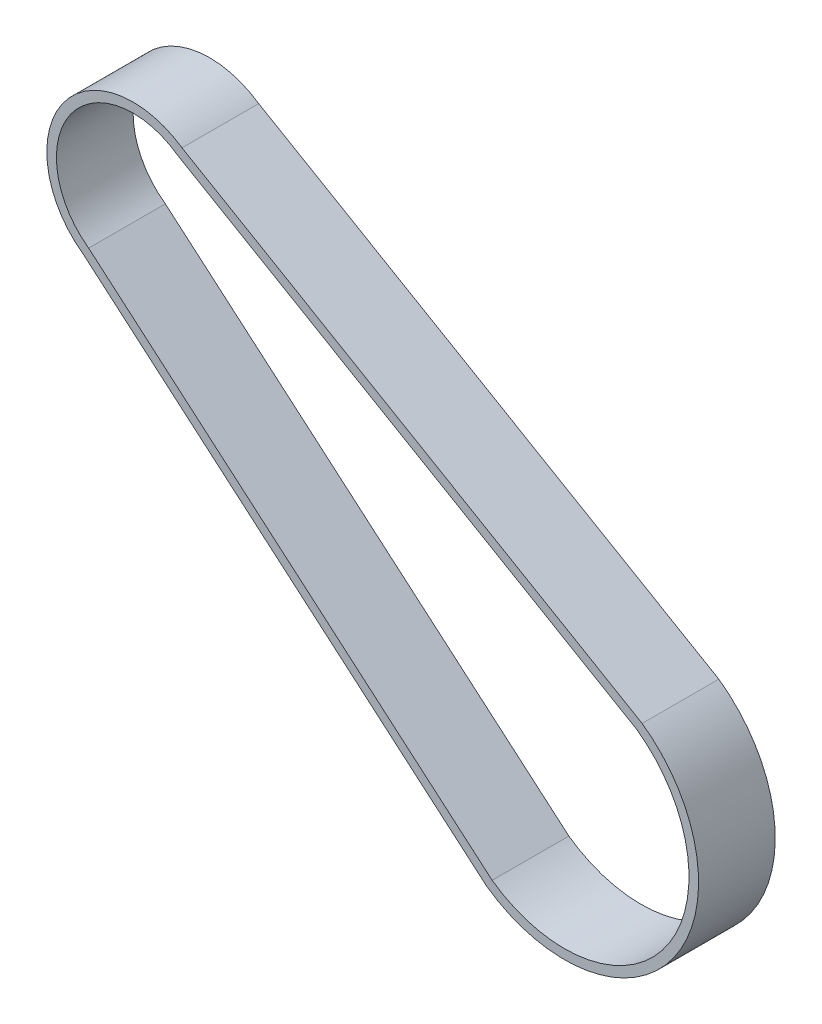
ISO-10303-21;
HEADER;
FILE_DESCRIPTION(('STEP AP214'),'2;1');
FILE_NAME('part.step','',(''),(''),'','','');
FILE_SCHEMA(('AUTOMOTIVE_DESIGN { 1 0 10303 214 1 1 1 1 }'));
ENDSEC;
DATA;
#1=APPLICATION_CONTEXT('core data for automotive mechanical design processes');
#2=APPLICATION_PROTOCOL_DEFINITION('international standard','automotive_design',2000,#1);
#3=PRODUCT_CONTEXT('',#1,'mechanical');
#4=PRODUCT('Part','Part','',(#3));
#5=PRODUCT_RELATED_PRODUCT_CATEGORY('part','',(#4));
#6=PRODUCT_DEFINITION_FORMATION('','',#4);
#7=PRODUCT_DEFINITION_CONTEXT('part definition',#1,'design');
#8=PRODUCT_DEFINITION('design','',#6,#7);
#9=PRODUCT_DEFINITION_SHAPE('','',#8);
#10=(LENGTH_UNIT() NAMED_UNIT(*) SI_UNIT(.MILLI.,.METRE.));
#11=(NAMED_UNIT(*) PLANE_ANGLE_UNIT() SI_UNIT($,.RADIAN.));
#12=(NAMED_UNIT(*) SI_UNIT($,.STERADIAN.) SOLID_ANGLE_UNIT());
#13=UNCERTAINTY_MEASURE_WITH_UNIT(LENGTH_MEASURE(1.E-05),#10,'distance_accuracy_value','');
#14=(GEOMETRIC_REPRESENTATION_CONTEXT(3) GLOBAL_UNCERTAINTY_ASSIGNED_CONTEXT((#13)) GLOBAL_UNIT_ASSIGNED_CONTEXT((#10,
#11,#12)) REPRESENTATION_CONTEXT('',''));
#15=CARTESIAN_POINT('',(0.,0.,0.));
#16=DIRECTION('',(0.,0.,1.));
#17=DIRECTION('',(1.,0.,0.));
#18=AXIS2_PLACEMENT_3D('',#15,#16,#17);
#19=CARTESIAN_POINT('',(-9.07207298131523,-10.587892968296,8.));
#20=DIRECTION('',(0.650656419559216,0.759372256331755,0.));
#21=DIRECTION('',(-0.759372256331755,0.650656419559216,0.));
#22=AXIS2_PLACEMENT_3D('',#19,#20,#21);
#23=PLANE('',#22);
#24=DIRECTION('',(0.759372256331755,-0.650656419559216,0.));
#25=VECTOR('',#24,1.);
#26=CARTESIAN_POINT('',(-9.07207298131523,-10.587892968296,0.));
#27=LINE('',#26,#25);
#28=CARTESIAN_POINT('',(-50.2157140772402,24.665402078881,0.));
#29=VERTEX_POINT('',#28);
#30=CARTESIAN_POINT('',(-8.11333300904005,-11.4093745439626,0.));
#31=VERTEX_POINT('',#30);
#32=EDGE_CURVE('E144',#29,#31,#27,.T.);
#33=ORIENTED_EDGE('',*,*,#32,.T.);
#34=DIRECTION('',(0.,0.,-1.));
#35=VECTOR('',#34,1.);
#36=CARTESIAN_POINT('',(-8.11333300904005,-11.4093745439626,8.));
#37=LINE('',#36,#35);
#38=CARTESIAN_POINT('',(-8.11333300904005,-11.4093745439626,8.));
#39=VERTEX_POINT('',#38);
#40=EDGE_CURVE('E11',#39,#31,#37,.T.);
#41=ORIENTED_EDGE('',*,*,#40,.F.);
#42=DIRECTION('',(0.759372256331755,-0.650656419559216,0.));
#43=VECTOR('',#42,1.);
#44=CARTESIAN_POINT('',(-9.07207298131523,-10.587892968296,8.));
#45=LINE('',#44,#43);
#46=CARTESIAN_POINT('',(-50.2157140772402,24.665402078881,8.));
#47=VERTEX_POINT('',#46);
#48=EDGE_CURVE('E116',#47,#39,#45,.T.);
#49=ORIENTED_EDGE('',*,*,#48,.F.);
#50=DIRECTION('',(0.,0.,-1.));
#51=VECTOR('',#50,1.);
#52=CARTESIAN_POINT('',(-50.2157140772402,24.665402078881,8.));
#53=LINE('',#52,#51);
#54=EDGE_CURVE('E55',#47,#29,#53,.T.);
#55=ORIENTED_EDGE('',*,*,#54,.T.);
#56=EDGE_LOOP('',(#33,#41,#49,#55));
#57=FACE_BOUND('',#56,.T.);
#58=ADVANCED_FACE('F36',(#57),#23,.F.);
#59=CARTESIAN_POINT('',(0.,0.,8.));
#60=DIRECTION('',(0.,0.,-1.));
#61=DIRECTION('',(-1.,0.,0.));
#62=AXIS2_PLACEMENT_3D('',#59,#60,#61);
#63=CYLINDRICAL_SURFACE('',#62,14.);
#64=CARTESIAN_POINT('',(0.,0.,0.));
#65=DIRECTION('',(0.,0.,1.));
#66=DIRECTION('',(1.,0.,0.));
#67=AXIS2_PLACEMENT_3D('',#64,#65,#66);
#68=CIRCLE('',#67,14.);
#69=CARTESIAN_POINT('',(8.11333300904004,11.4093745439626,0.));
#70=VERTEX_POINT('',#69);
#71=EDGE_CURVE('E122',#31,#70,#68,.T.);
#72=ORIENTED_EDGE('',*,*,#71,.T.);
#73=DIRECTION('',(0.,0.,-1.));
#74=VECTOR('',#73,1.);
#75=CARTESIAN_POINT('',(8.11333300904004,11.4093745439626,8.));
#76=LINE('',#75,#74);
#77=CARTESIAN_POINT('',(8.11333300904004,11.4093745439626,8.));
#78=VERTEX_POINT('',#77);
#79=EDGE_CURVE('E46',#78,#70,#76,.T.);
#80=ORIENTED_EDGE('',*,*,#79,.F.);
#81=CARTESIAN_POINT('',(0.,0.,8.));
#82=DIRECTION('',(0.,0.,1.));
#83=DIRECTION('',(1.,0.,0.));
#84=AXIS2_PLACEMENT_3D('',#81,#82,#83);
#85=CIRCLE('',#84,14.);
#86=EDGE_CURVE('E110',#39,#78,#85,.T.);
#87=ORIENTED_EDGE('',*,*,#86,.F.);
#88=ORIENTED_EDGE('',*,*,#40,.T.);
#89=EDGE_LOOP('',(#72,#80,#87,#88));
#90=FACE_BOUND('',#89,.T.);
#91=ADVANCED_FACE('F121',(#90),#63,.T.);
#92=CARTESIAN_POINT('',(7.02512635203458,12.0441072875422,8.));
#93=DIRECTION('',(0.503838763475706,0.863797719619166,0.));
#94=DIRECTION('',(-0.863797719619166,0.503838763475706,0.));
#95=AXIS2_PLACEMENT_3D('',#92,#93,#94);
#96=PLANE('',#95);
#97=DIRECTION('',(0.863797719619166,-0.503838763475706,0.));
#98=VECTOR('',#97,1.);
#99=CARTESIAN_POINT('',(7.02512635203458,12.0441072875422,0.));
#100=LINE('',#99,#98);
#101=CARTESIAN_POINT('',(-39.8926275033139,39.4104484466255,0.));
#102=VERTEX_POINT('',#101);
#103=EDGE_CURVE('E147',#102,#70,#100,.T.);
#104=ORIENTED_EDGE('',*,*,#103,.F.);
#105=DIRECTION('',(0.,0.,-1.));
#106=VECTOR('',#105,1.);
#107=CARTESIAN_POINT('',(-39.8926275033139,39.4104484466255,8.));
#108=LINE('',#107,#106);
#109=CARTESIAN_POINT('',(-39.8926275033139,39.4104484466255,8.));
#110=VERTEX_POINT('',#109);
#111=EDGE_CURVE('E81',#110,#102,#108,.T.);
#112=ORIENTED_EDGE('',*,*,#111,.F.);
#113=DIRECTION('',(0.863797719619166,-0.503838763475706,0.));
#114=VECTOR('',#113,1.);
#115=CARTESIAN_POINT('',(7.02512635203458,12.0441072875422,8.));
#116=LINE('',#115,#114);
#117=EDGE_CURVE('E115',#110,#78,#116,.T.);
#118=ORIENTED_EDGE('',*,*,#117,.T.);
#119=ORIENTED_EDGE('',*,*,#79,.T.);
#120=EDGE_LOOP('',(#104,#112,#118,#119));
#121=FACE_BOUND('',#120,.T.);
#122=ADVANCED_FACE('F126',(#121),#96,.T.);
#123=CARTESIAN_POINT('',(6.52100986335441,11.1849005204723,8.));
#124=DIRECTION('',(0.503668423173719,0.863897053761442,0.));
#125=DIRECTION('',(-0.863897053761442,0.503668423173719,0.));
#126=AXIS2_PLACEMENT_3D('',#123,#124,#125);
#127=PLANE('',#126);
#128=DIRECTION('',(0.863897053761442,-0.503668423173719,0.));
#129=VECTOR('',#128,1.);
#130=CARTESIAN_POINT('',(6.52100986335441,11.1849005204723,0.));
#131=LINE('',#130,#129);
#132=CARTESIAN_POINT('',(-40.36380970912,38.51964259655,0.));
#133=VERTEX_POINT('',#132);
#134=CARTESIAN_POINT('',(7.53380922268005,10.5944192193938,0.));
#135=VERTEX_POINT('',#134);
#136=EDGE_CURVE('E133',#133,#135,#131,.T.);
#137=ORIENTED_EDGE('',*,*,#136,.T.);
#138=DIRECTION('',(0.,0.,-1.));
#139=VECTOR('',#138,1.);
#140=CARTESIAN_POINT('',(7.53380922268005,10.5944192193938,8.));
#141=LINE('',#140,#139);
#142=CARTESIAN_POINT('',(7.53380922268005,10.5944192193938,8.));
#143=VERTEX_POINT('',#142);
#144=EDGE_CURVE('E40',#143,#135,#141,.T.);
#145=ORIENTED_EDGE('',*,*,#144,.F.);
#146=DIRECTION('',(0.863897053761442,-0.503668423173719,0.));
#147=VECTOR('',#146,1.);
#148=CARTESIAN_POINT('',(6.52100986335441,11.1849005204723,8.));
#149=LINE('',#148,#147);
#150=CARTESIAN_POINT('',(-40.36380970912,38.51964259655,8.));
#151=VERTEX_POINT('',#150);
#152=EDGE_CURVE('E152',#151,#143,#149,.T.);
#153=ORIENTED_EDGE('',*,*,#152,.F.);
#154=DIRECTION('',(0.,0.,-1.));
#155=VECTOR('',#154,1.);
#156=CARTESIAN_POINT('',(-40.36380970912,38.51964259655,8.));
#157=LINE('',#156,#155);
#158=EDGE_CURVE('E129',#151,#133,#157,.T.);
#159=ORIENTED_EDGE('',*,*,#158,.T.);
#160=EDGE_LOOP('',(#137,#145,#153,#159));
#161=FACE_BOUND('',#160,.T.);
#162=ADVANCED_FACE('F38',(#161),#127,.F.);
#163=CARTESIAN_POINT('',(0.,0.,8.));
#164=DIRECTION('',(0.,0.,-1.));
#165=DIRECTION('',(-1.,0.,0.));
#166=AXIS2_PLACEMENT_3D('',#163,#164,#165);
#167=CYLINDRICAL_SURFACE('',#166,13.);
#168=CARTESIAN_POINT('',(0.,0.,0.));
#169=DIRECTION('',(0.,0.,1.));
#170=DIRECTION('',(1.,0.,0.));
#171=AXIS2_PLACEMENT_3D('',#168,#169,#170);
#172=CIRCLE('',#171,13.);
#173=CARTESIAN_POINT('',(-7.53380922268005,-10.5944192193938,0.));
#174=VERTEX_POINT('',#173);
#175=EDGE_CURVE('E136',#135,#174,#172,.F.);
#176=ORIENTED_EDGE('',*,*,#175,.T.);
#177=DIRECTION('',(0.,0.,-1.));
#178=VECTOR('',#177,1.);
#179=CARTESIAN_POINT('',(-7.53380922268005,-10.5944192193938,8.));
#180=LINE('',#179,#178);
#181=CARTESIAN_POINT('',(-7.53380922268005,-10.5944192193938,8.));
#182=VERTEX_POINT('',#181);
#183=EDGE_CURVE('E158',#182,#174,#180,.T.);
#184=ORIENTED_EDGE('',*,*,#183,.F.);
#185=CARTESIAN_POINT('',(0.,0.,8.));
#186=DIRECTION('',(0.,0.,1.));
#187=DIRECTION('',(1.,0.,0.));
#188=AXIS2_PLACEMENT_3D('',#185,#186,#187);
#189=CIRCLE('',#188,13.);
#190=EDGE_CURVE('E94',#143,#182,#189,.F.);
#191=ORIENTED_EDGE('',*,*,#190,.F.);
#192=ORIENTED_EDGE('',*,*,#144,.T.);
#193=EDGE_LOOP('',(#176,#184,#191,#192));
#194=FACE_BOUND('',#193,.T.);
#195=ADVANCED_FACE('F163',(#194),#167,.F.);
#196=CARTESIAN_POINT('',(-8.42406776836417,-9.83161489913199,8.));
#197=DIRECTION('',(0.650656419559219,0.759372256331753,0.));
#198=DIRECTION('',(-0.759372256331753,0.650656419559219,0.));
#199=AXIS2_PLACEMENT_3D('',#196,#197,#198);
#200=PLANE('',#199);
#201=DIRECTION('',(0.759372256331753,-0.650656419559219,0.));
#202=VECTOR('',#201,1.);
#203=CARTESIAN_POINT('',(-8.42406776836417,-9.83161489913199,0.));
#204=LINE('',#203,#202);
#205=CARTESIAN_POINT('',(-49.63619029088,25.48035740345,0.));
#206=VERTEX_POINT('',#205);
#207=EDGE_CURVE('E139',#206,#174,#204,.T.);
#208=ORIENTED_EDGE('',*,*,#207,.F.);
#209=DIRECTION('',(0.,0.,-1.));
#210=VECTOR('',#209,1.);
#211=CARTESIAN_POINT('',(-49.63619029088,25.48035740345,8.));
#212=LINE('',#211,#210);
#213=CARTESIAN_POINT('',(-49.63619029088,25.48035740345,8.));
#214=VERTEX_POINT('',#213);
#215=EDGE_CURVE('E157',#214,#206,#212,.T.);
#216=ORIENTED_EDGE('',*,*,#215,.F.);
#217=DIRECTION('',(0.759372256331753,-0.650656419559219,0.));
#218=VECTOR('',#217,1.);
#219=CARTESIAN_POINT('',(-8.42406776836417,-9.83161489913199,8.));
#220=LINE('',#219,#218);
#221=EDGE_CURVE('E175',#214,#182,#220,.T.);
#222=ORIENTED_EDGE('',*,*,#221,.T.);
#223=ORIENTED_EDGE('',*,*,#183,.T.);
#224=EDGE_LOOP('',(#208,#216,#222,#223));
#225=FACE_BOUND('',#224,.T.);
#226=ADVANCED_FACE('F172',(#225),#200,.T.);
#227=CARTESIAN_POINT('',(-45.,32.,8.));
#228=DIRECTION('',(0.,0.,-1.));
#229=DIRECTION('',(-1.,0.,0.));
#230=AXIS2_PLACEMENT_3D('',#227,#228,#229);
#231=CYLINDRICAL_SURFACE('',#230,8.);
#232=CARTESIAN_POINT('',(-45.,32.,0.));
#233=DIRECTION('',(0.,0.,1.));
#234=DIRECTION('',(1.,0.,0.));
#235=AXIS2_PLACEMENT_3D('',#232,#233,#234);
#236=CIRCLE('',#235,8.);
#237=EDGE_CURVE('E142',#206,#133,#236,.F.);
#238=ORIENTED_EDGE('',*,*,#237,.T.);
#239=ORIENTED_EDGE('',*,*,#158,.F.);
#240=CARTESIAN_POINT('',(-45.,32.,8.));
#241=DIRECTION('',(0.,0.,1.));
#242=DIRECTION('',(1.,0.,0.));
#243=AXIS2_PLACEMENT_3D('',#240,#241,#242);
#244=CIRCLE('',#243,8.);
#245=EDGE_CURVE('E177',#214,#151,#244,.F.);
#246=ORIENTED_EDGE('',*,*,#245,.F.);
#247=ORIENTED_EDGE('',*,*,#215,.T.);
#248=EDGE_LOOP('',(#238,#239,#246,#247));
#249=FACE_BOUND('',#248,.T.);
#250=ADVANCED_FACE('F178',(#249),#231,.F.);
#251=CARTESIAN_POINT('',(-45.,32.,8.));
#252=DIRECTION('',(0.,0.,-1.));
#253=DIRECTION('',(-1.,0.,0.));
#254=AXIS2_PLACEMENT_3D('',#251,#252,#253);
#255=CYLINDRICAL_SURFACE('',#254,9.00000000000021);
#256=CARTESIAN_POINT('',(-45.,32.,0.));
#257=DIRECTION('',(0.,0.,1.));
#258=DIRECTION('',(1.,0.,0.));
#259=AXIS2_PLACEMENT_3D('',#256,#257,#258);
#260=CIRCLE('',#259,9.00000000000021);
#261=EDGE_CURVE('E149',#29,#102,#260,.F.);
#262=ORIENTED_EDGE('',*,*,#261,.F.);
#263=ORIENTED_EDGE('',*,*,#54,.F.);
#264=CARTESIAN_POINT('',(-45.,32.,8.));
#265=DIRECTION('',(0.,0.,1.));
#266=DIRECTION('',(1.,0.,0.));
#267=AXIS2_PLACEMENT_3D('',#264,#265,#266);
#268=CIRCLE('',#267,9.00000000000021);
#269=EDGE_CURVE('E127',#47,#110,#268,.F.);
#270=ORIENTED_EDGE('',*,*,#269,.T.);
#271=ORIENTED_EDGE('',*,*,#111,.T.);
#272=EDGE_LOOP('',(#262,#263,#270,#271));
#273=FACE_BOUND('',#272,.T.);
#274=ADVANCED_FACE('F185',(#273),#255,.T.);
#275=CARTESIAN_POINT('',(0.,0.,8.));
#276=DIRECTION('',(0.,0.,1.));
#277=DIRECTION('',(1.,0.,0.));
#278=AXIS2_PLACEMENT_3D('',#275,#276,#277);
#279=PLANE('',#278);
#280=ORIENTED_EDGE('',*,*,#152,.T.);
#281=ORIENTED_EDGE('',*,*,#190,.T.);
#282=ORIENTED_EDGE('',*,*,#221,.F.);
#283=ORIENTED_EDGE('',*,*,#245,.T.);
#284=EDGE_LOOP('',(#280,#281,#282,#283));
#285=FACE_BOUND('',#284,.T.);
#286=ORIENTED_EDGE('',*,*,#48,.T.);
#287=ORIENTED_EDGE('',*,*,#86,.T.);
#288=ORIENTED_EDGE('',*,*,#117,.F.);
#289=ORIENTED_EDGE('',*,*,#269,.F.);
#290=EDGE_LOOP('',(#286,#287,#288,#289));
#291=FACE_BOUND('',#290,.T.);
#292=ADVANCED_FACE('F112',(#285,#291),#279,.T.);
#293=CARTESIAN_POINT('',(0.,0.,0.));
#294=DIRECTION('',(0.,0.,1.));
#295=DIRECTION('',(1.,0.,0.));
#296=AXIS2_PLACEMENT_3D('',#293,#294,#295);
#297=PLANE('',#296);
#298=ORIENTED_EDGE('',*,*,#136,.F.);
#299=ORIENTED_EDGE('',*,*,#237,.F.);
#300=ORIENTED_EDGE('',*,*,#207,.T.);
#301=ORIENTED_EDGE('',*,*,#175,.F.);
#302=EDGE_LOOP('',(#298,#299,#300,#301));
#303=FACE_BOUND('',#302,.T.);
#304=ORIENTED_EDGE('',*,*,#32,.F.);
#305=ORIENTED_EDGE('',*,*,#261,.T.);
#306=ORIENTED_EDGE('',*,*,#103,.T.);
#307=ORIENTED_EDGE('',*,*,#71,.F.);
#308=EDGE_LOOP('',(#304,#305,#306,#307));
#309=FACE_BOUND('',#308,.T.);
#310=ADVANCED_FACE('F170',(#303,#309),#297,.F.);
#311=CLOSED_SHELL('',(#58,#91,#122,#162,#195,#226,#250,#274,#292,#310));
#312=MANIFOLD_SOLID_BREP('B2',#311);
#313=ADVANCED_BREP_SHAPE_REPRESENTATION('',(#18,#312),#14);
#314=SHAPE_DEFINITION_REPRESENTATION(#9,#313);
ENDSEC;
END-ISO-10303-21;
